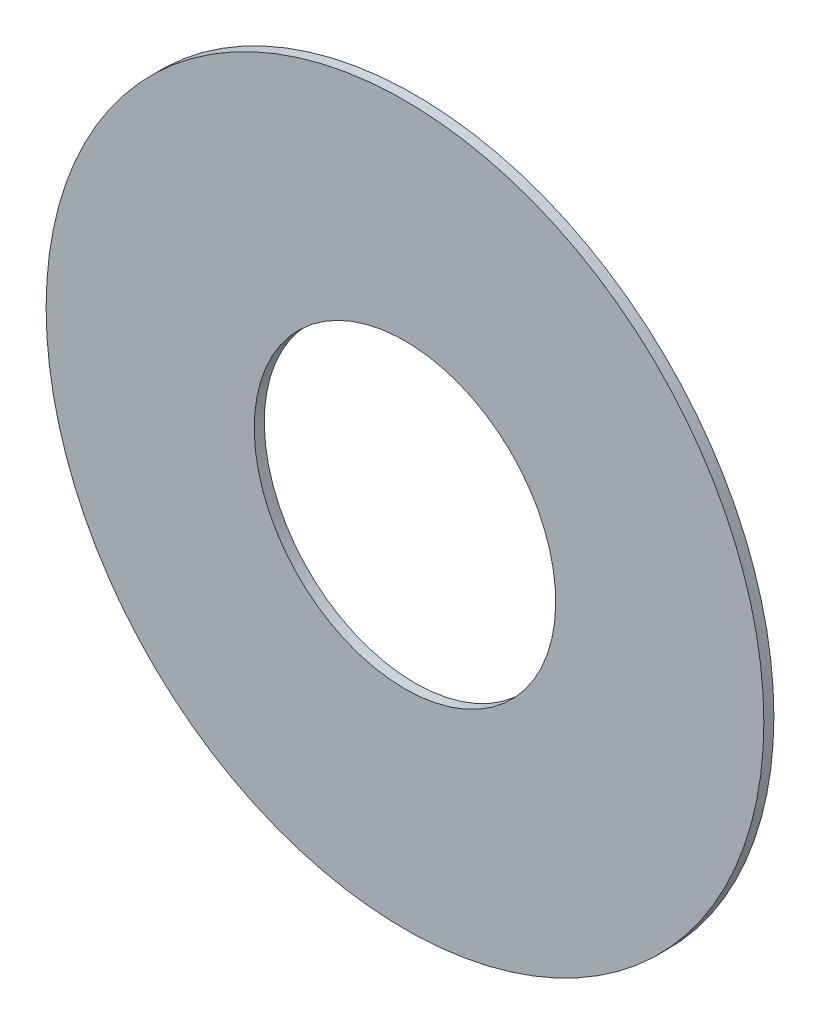
ISO-10303-21;
HEADER;
FILE_DESCRIPTION(('STEP AP214'),'2;1');
FILE_NAME('part.step','',(''),(''),'','','');
FILE_SCHEMA(('AUTOMOTIVE_DESIGN { 1 0 10303 214 1 1 1 1 }'));
ENDSEC;
DATA;
#1=APPLICATION_CONTEXT('core data for automotive mechanical design processes');
#2=APPLICATION_PROTOCOL_DEFINITION('international standard','automotive_design',2000,#1);
#3=PRODUCT_CONTEXT('',#1,'mechanical');
#4=PRODUCT('Part','Part','',(#3));
#5=PRODUCT_RELATED_PRODUCT_CATEGORY('part','',(#4));
#6=PRODUCT_DEFINITION_FORMATION('','',#4);
#7=PRODUCT_DEFINITION_CONTEXT('part definition',#1,'design');
#8=PRODUCT_DEFINITION('design','',#6,#7);
#9=PRODUCT_DEFINITION_SHAPE('','',#8);
#10=(LENGTH_UNIT() NAMED_UNIT(*) SI_UNIT(.MILLI.,.METRE.));
#11=(NAMED_UNIT(*) PLANE_ANGLE_UNIT() SI_UNIT($,.RADIAN.));
#12=(NAMED_UNIT(*) SI_UNIT($,.STERADIAN.) SOLID_ANGLE_UNIT());
#13=UNCERTAINTY_MEASURE_WITH_UNIT(LENGTH_MEASURE(1.E-05),#10,'distance_accuracy_value','');
#14=(GEOMETRIC_REPRESENTATION_CONTEXT(3) GLOBAL_UNCERTAINTY_ASSIGNED_CONTEXT((#13)) GLOBAL_UNIT_ASSIGNED_CONTEXT((#10,
#11,#12)) REPRESENTATION_CONTEXT('',''));
#15=CARTESIAN_POINT('',(0.,0.,0.));
#16=DIRECTION('',(0.,0.,1.));
#17=DIRECTION('',(1.,0.,0.));
#18=AXIS2_PLACEMENT_3D('',#15,#16,#17);
#19=CARTESIAN_POINT('',(149.102,-113.984,-0.045));
#20=DIRECTION('',(0.,0.,-1.));
#21=DIRECTION('',(0.,-1.,0.));
#22=AXIS2_PLACEMENT_3D('',#19,#20,#21);
#23=CYLINDRICAL_SURFACE('',#22,0.525);
#24=CARTESIAN_POINT('',(149.102,-113.984,1.67));
#25=DIRECTION('',(0.,0.,-1.));
#26=DIRECTION('',(0.,-1.,0.));
#27=AXIS2_PLACEMENT_3D('',#24,#25,#26);
#28=CIRCLE('',#27,0.525);
#29=CARTESIAN_POINT('',(149.102,-114.509,1.67));
#30=VERTEX_POINT('',#29);
#31=EDGE_CURVE('E25',#30,#30,#28,.T.);
#32=ORIENTED_EDGE('',*,*,#31,.T.);
#33=DIRECTION('',(0.,0.,1.));
#34=VECTOR('',#33,1.);
#35=CARTESIAN_POINT('',(149.102,-114.509,-0.045));
#36=LINE('',#35,#34);
#37=CARTESIAN_POINT('',(149.102,-114.509,1.705));
#38=VERTEX_POINT('',#37);
#39=EDGE_CURVE('E11',#30,#38,#36,.T.);
#40=ORIENTED_EDGE('',*,*,#39,.T.);
#41=CARTESIAN_POINT('',(149.102,-113.984,1.705));
#42=DIRECTION('',(0.,0.,-1.));
#43=DIRECTION('',(0.,-1.,0.));
#44=AXIS2_PLACEMENT_3D('',#41,#42,#43);
#45=CIRCLE('',#44,0.525);
#46=EDGE_CURVE('E68',#38,#38,#45,.T.);
#47=ORIENTED_EDGE('',*,*,#46,.F.);
#48=ORIENTED_EDGE('',*,*,#39,.F.);
#49=EDGE_LOOP('',(#32,#40,#47,#48));
#50=FACE_BOUND('',#49,.T.);
#51=ADVANCED_FACE('F17',(#50),#23,.F.);
#52=CARTESIAN_POINT('',(149.102,-113.984,1.67));
#53=DIRECTION('',(0.,0.,1.));
#54=DIRECTION('',(1.,0.,0.));
#55=AXIS2_PLACEMENT_3D('',#52,#53,#54);
#56=PLANE('',#55);
#57=ORIENTED_EDGE('',*,*,#31,.F.);
#58=EDGE_LOOP('',(#57));
#59=FACE_BOUND('',#58,.T.);
#60=CARTESIAN_POINT('',(149.102,-113.984,1.67));
#61=DIRECTION('',(0.,0.,1.));
#62=DIRECTION('',(1.,0.,0.));
#63=AXIS2_PLACEMENT_3D('',#60,#61,#62);
#64=CIRCLE('',#63,1.25);
#65=CARTESIAN_POINT('',(150.352,-113.984,1.67));
#66=VERTEX_POINT('',#65);
#67=EDGE_CURVE('E56',#66,#66,#64,.T.);
#68=ORIENTED_EDGE('',*,*,#67,.F.);
#69=EDGE_LOOP('',(#68));
#70=FACE_BOUND('',#69,.T.);
#71=ADVANCED_FACE('F77',(#59,#70),#56,.F.);
#72=CARTESIAN_POINT('',(149.102,-113.984,1.705));
#73=DIRECTION('',(0.,0.,1.));
#74=DIRECTION('',(1.,0.,0.));
#75=AXIS2_PLACEMENT_3D('',#72,#73,#74);
#76=PLANE('',#75);
#77=ORIENTED_EDGE('',*,*,#46,.T.);
#78=EDGE_LOOP('',(#77));
#79=FACE_BOUND('',#78,.T.);
#80=CARTESIAN_POINT('',(149.102,-113.984,1.705));
#81=DIRECTION('',(0.,0.,1.));
#82=DIRECTION('',(1.,0.,0.));
#83=AXIS2_PLACEMENT_3D('',#80,#81,#82);
#84=CIRCLE('',#83,1.25);
#85=CARTESIAN_POINT('',(150.352,-113.984,1.705));
#86=VERTEX_POINT('',#85);
#87=EDGE_CURVE('E54',#86,#86,#84,.T.);
#88=ORIENTED_EDGE('',*,*,#87,.T.);
#89=EDGE_LOOP('',(#88));
#90=FACE_BOUND('',#89,.T.);
#91=ADVANCED_FACE('F60',(#79,#90),#76,.T.);
#92=CARTESIAN_POINT('',(149.102,-113.984,1.67));
#93=DIRECTION('',(0.,0.,1.));
#94=DIRECTION('',(1.,0.,0.));
#95=AXIS2_PLACEMENT_3D('',#92,#93,#94);
#96=CYLINDRICAL_SURFACE('',#95,1.25);
#97=ORIENTED_EDGE('',*,*,#87,.F.);
#98=DIRECTION('',(0.,0.,1.));
#99=VECTOR('',#98,1.);
#100=CARTESIAN_POINT('',(150.352,-113.984,1.67));
#101=LINE('',#100,#99);
#102=EDGE_CURVE('E51',#66,#86,#101,.T.);
#103=ORIENTED_EDGE('',*,*,#102,.F.);
#104=ORIENTED_EDGE('',*,*,#67,.T.);
#105=ORIENTED_EDGE('',*,*,#102,.T.);
#106=EDGE_LOOP('',(#97,#103,#104,#105));
#107=FACE_BOUND('',#106,.T.);
#108=ADVANCED_FACE('F53',(#107),#96,.T.);
#109=CLOSED_SHELL('',(#51,#71,#91,#108));
#110=MANIFOLD_SOLID_BREP('B1',#109);
#111=ADVANCED_BREP_SHAPE_REPRESENTATION('',(#18,#110),#14);
#112=SHAPE_DEFINITION_REPRESENTATION(#9,#111);
ENDSEC;
END-ISO-10303-21;
